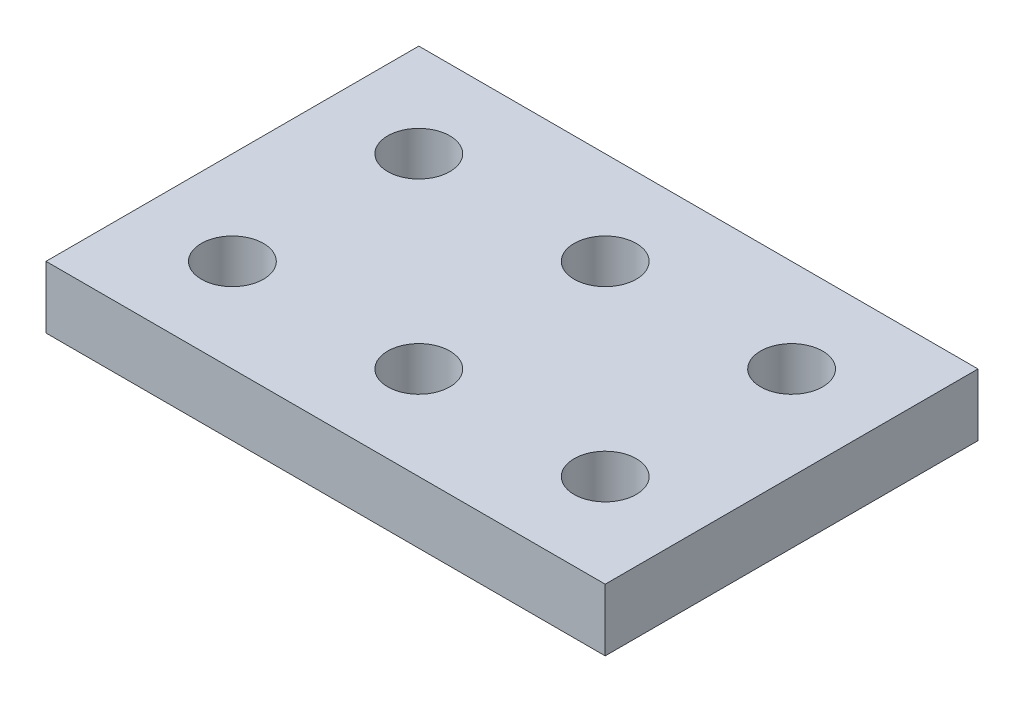
ISO-10303-21;
HEADER;
FILE_DESCRIPTION(('STEP AP214'),'2;1');
FILE_NAME('part.step','',(''),(''),'','','');
FILE_SCHEMA(('AUTOMOTIVE_DESIGN { 1 0 10303 214 1 1 1 1 }'));
ENDSEC;
DATA;
#1=APPLICATION_CONTEXT('core data for automotive mechanical design processes');
#2=APPLICATION_PROTOCOL_DEFINITION('international standard','automotive_design',2000,#1);
#3=PRODUCT_CONTEXT('',#1,'mechanical');
#4=PRODUCT('Part','Part','',(#3));
#5=PRODUCT_RELATED_PRODUCT_CATEGORY('part','',(#4));
#6=PRODUCT_DEFINITION_FORMATION('','',#4);
#7=PRODUCT_DEFINITION_CONTEXT('part definition',#1,'design');
#8=PRODUCT_DEFINITION('design','',#6,#7);
#9=PRODUCT_DEFINITION_SHAPE('','',#8);
#10=(LENGTH_UNIT() NAMED_UNIT(*) SI_UNIT(.MILLI.,.METRE.));
#11=(NAMED_UNIT(*) PLANE_ANGLE_UNIT() SI_UNIT($,.RADIAN.));
#12=(NAMED_UNIT(*) SI_UNIT($,.STERADIAN.) SOLID_ANGLE_UNIT());
#13=UNCERTAINTY_MEASURE_WITH_UNIT(LENGTH_MEASURE(1.E-05),#10,'distance_accuracy_value','');
#14=(GEOMETRIC_REPRESENTATION_CONTEXT(3) GLOBAL_UNCERTAINTY_ASSIGNED_CONTEXT((#13)) GLOBAL_UNIT_ASSIGNED_CONTEXT((#10,
#11,#12)) REPRESENTATION_CONTEXT('',''));
#15=CARTESIAN_POINT('',(0.,0.,0.));
#16=DIRECTION('',(0.,0.,1.));
#17=DIRECTION('',(1.,0.,0.));
#18=AXIS2_PLACEMENT_3D('',#15,#16,#17);
#19=CARTESIAN_POINT('',(0.,9.99999999999999,0.));
#20=DIRECTION('',(0.,1.,0.));
#21=DIRECTION('',(0.,0.,1.));
#22=AXIS2_PLACEMENT_3D('',#19,#20,#21);
#23=PLANE('',#22);
#24=CARTESIAN_POINT('',(75.0000000000003,10.,-15.));
#25=DIRECTION('',(0.,1.,0.));
#26=DIRECTION('',(0.,0.,1.));
#27=AXIS2_PLACEMENT_3D('',#24,#25,#26);
#28=CIRCLE('',#27,4.99999999999999);
#29=CARTESIAN_POINT('',(75.0000000000003,10.,-10.));
#30=VERTEX_POINT('',#29);
#31=EDGE_CURVE('E132',#30,#30,#28,.T.);
#32=ORIENTED_EDGE('',*,*,#31,.F.);
#33=EDGE_LOOP('',(#32));
#34=FACE_BOUND('',#33,.T.);
#35=CARTESIAN_POINT('',(75.,10.,-45.));
#36=DIRECTION('',(0.,1.,0.));
#37=DIRECTION('',(0.,0.,1.));
#38=AXIS2_PLACEMENT_3D('',#35,#36,#37);
#39=CIRCLE('',#38,5.);
#40=CARTESIAN_POINT('',(75.,10.,-40.));
#41=VERTEX_POINT('',#40);
#42=EDGE_CURVE('E120',#41,#41,#39,.T.);
#43=ORIENTED_EDGE('',*,*,#42,.F.);
#44=EDGE_LOOP('',(#43));
#45=FACE_BOUND('',#44,.T.);
#46=CARTESIAN_POINT('',(15.,10.,-45.));
#47=DIRECTION('',(0.,1.,0.));
#48=DIRECTION('',(0.,0.,1.));
#49=AXIS2_PLACEMENT_3D('',#46,#47,#48);
#50=CIRCLE('',#49,5.);
#51=CARTESIAN_POINT('',(15.,10.,-40.));
#52=VERTEX_POINT('',#51);
#53=EDGE_CURVE('E99',#52,#52,#50,.T.);
#54=ORIENTED_EDGE('',*,*,#53,.F.);
#55=EDGE_LOOP('',(#54));
#56=FACE_BOUND('',#55,.T.);
#57=DIRECTION('',(0.,0.,1.));
#58=VECTOR('',#57,1.);
#59=CARTESIAN_POINT('',(0.,9.99999999999999,-60.));
#60=LINE('',#59,#58);
#61=CARTESIAN_POINT('',(0.,9.99999999999999,-60.));
#62=VERTEX_POINT('',#61);
#63=CARTESIAN_POINT('',(0.,9.99999999999999,0.));
#64=VERTEX_POINT('',#63);
#65=EDGE_CURVE('E84',#62,#64,#60,.T.);
#66=ORIENTED_EDGE('',*,*,#65,.T.);
#67=DIRECTION('',(1.,0.,0.));
#68=VECTOR('',#67,1.);
#69=CARTESIAN_POINT('',(0.,9.99999999999999,0.));
#70=LINE('',#69,#68);
#71=CARTESIAN_POINT('',(90.,10.,0.));
#72=VERTEX_POINT('',#71);
#73=EDGE_CURVE('E79',#64,#72,#70,.T.);
#74=ORIENTED_EDGE('',*,*,#73,.T.);
#75=DIRECTION('',(0.,0.,-1.));
#76=VECTOR('',#75,1.);
#77=CARTESIAN_POINT('',(90.,10.,0.));
#78=LINE('',#77,#76);
#79=CARTESIAN_POINT('',(90.,10.,-60.));
#80=VERTEX_POINT('',#79);
#81=EDGE_CURVE('E82',#72,#80,#78,.T.);
#82=ORIENTED_EDGE('',*,*,#81,.T.);
#83=DIRECTION('',(-1.,0.,0.));
#84=VECTOR('',#83,1.);
#85=CARTESIAN_POINT('',(90.,10.,-60.));
#86=LINE('',#85,#84);
#87=EDGE_CURVE('E49',#80,#62,#86,.T.);
#88=ORIENTED_EDGE('',*,*,#87,.T.);
#89=EDGE_LOOP('',(#66,#74,#82,#88));
#90=FACE_BOUND('',#89,.T.);
#91=CARTESIAN_POINT('',(45.,10.0000000000001,-45.));
#92=DIRECTION('',(0.,1.,0.));
#93=DIRECTION('',(0.,0.,1.));
#94=AXIS2_PLACEMENT_3D('',#91,#92,#93);
#95=CIRCLE('',#94,5.);
#96=CARTESIAN_POINT('',(45.,10.0000000000001,-40.));
#97=VERTEX_POINT('',#96);
#98=EDGE_CURVE('E114',#97,#97,#95,.T.);
#99=ORIENTED_EDGE('',*,*,#98,.F.);
#100=EDGE_LOOP('',(#99));
#101=FACE_BOUND('',#100,.T.);
#102=CARTESIAN_POINT('',(45.0000000000003,10.0000000000001,-15.));
#103=DIRECTION('',(0.,1.,0.));
#104=DIRECTION('',(0.,0.,1.));
#105=AXIS2_PLACEMENT_3D('',#102,#103,#104);
#106=CIRCLE('',#105,5.);
#107=CARTESIAN_POINT('',(45.0000000000003,10.0000000000001,-10.));
#108=VERTEX_POINT('',#107);
#109=EDGE_CURVE('E126',#108,#108,#106,.T.);
#110=ORIENTED_EDGE('',*,*,#109,.F.);
#111=EDGE_LOOP('',(#110));
#112=FACE_BOUND('',#111,.T.);
#113=CARTESIAN_POINT('',(15.0000000000003,10.,-15.));
#114=DIRECTION('',(0.,1.,0.));
#115=DIRECTION('',(0.,0.,1.));
#116=AXIS2_PLACEMENT_3D('',#113,#114,#115);
#117=CIRCLE('',#116,5.);
#118=CARTESIAN_POINT('',(15.0000000000003,10.,-10.));
#119=VERTEX_POINT('',#118);
#120=EDGE_CURVE('E138',#119,#119,#117,.T.);
#121=ORIENTED_EDGE('',*,*,#120,.F.);
#122=EDGE_LOOP('',(#121));
#123=FACE_BOUND('',#122,.T.);
#124=ADVANCED_FACE('F32',(#34,#45,#56,#90,#101,#112,#123),#23,.T.);
#125=CARTESIAN_POINT('',(0.,0.,0.));
#126=DIRECTION('',(0.,1.,0.));
#127=DIRECTION('',(0.,0.,1.));
#128=AXIS2_PLACEMENT_3D('',#125,#126,#127);
#129=PLANE('',#128);
#130=DIRECTION('',(0.,0.,1.));
#131=VECTOR('',#130,1.);
#132=CARTESIAN_POINT('',(0.,0.,-60.));
#133=LINE('',#132,#131);
#134=CARTESIAN_POINT('',(0.,0.,-60.));
#135=VERTEX_POINT('',#134);
#136=CARTESIAN_POINT('',(0.,0.,0.));
#137=VERTEX_POINT('',#136);
#138=EDGE_CURVE('E96',#135,#137,#133,.T.);
#139=ORIENTED_EDGE('',*,*,#138,.F.);
#140=DIRECTION('',(-1.,0.,0.));
#141=VECTOR('',#140,1.);
#142=CARTESIAN_POINT('',(90.,0.,-60.));
#143=LINE('',#142,#141);
#144=CARTESIAN_POINT('',(90.,0.,-60.));
#145=VERTEX_POINT('',#144);
#146=EDGE_CURVE('E72',#145,#135,#143,.T.);
#147=ORIENTED_EDGE('',*,*,#146,.F.);
#148=DIRECTION('',(0.,0.,-1.));
#149=VECTOR('',#148,1.);
#150=CARTESIAN_POINT('',(90.,0.,0.));
#151=LINE('',#150,#149);
#152=CARTESIAN_POINT('',(90.,0.,0.));
#153=VERTEX_POINT('',#152);
#154=EDGE_CURVE('E66',#153,#145,#151,.T.);
#155=ORIENTED_EDGE('',*,*,#154,.F.);
#156=DIRECTION('',(1.,0.,0.));
#157=VECTOR('',#156,1.);
#158=CARTESIAN_POINT('',(0.,0.,0.));
#159=LINE('',#158,#157);
#160=EDGE_CURVE('E88',#137,#153,#159,.T.);
#161=ORIENTED_EDGE('',*,*,#160,.F.);
#162=EDGE_LOOP('',(#139,#147,#155,#161));
#163=FACE_BOUND('',#162,.T.);
#164=CARTESIAN_POINT('',(15.,0.,-45.));
#165=DIRECTION('',(0.,1.,0.));
#166=DIRECTION('',(0.,0.,1.));
#167=AXIS2_PLACEMENT_3D('',#164,#165,#166);
#168=CIRCLE('',#167,5.);
#169=CARTESIAN_POINT('',(15.,0.,-40.));
#170=VERTEX_POINT('',#169);
#171=EDGE_CURVE('E111',#170,#170,#168,.T.);
#172=ORIENTED_EDGE('',*,*,#171,.T.);
#173=EDGE_LOOP('',(#172));
#174=FACE_BOUND('',#173,.T.);
#175=CARTESIAN_POINT('',(44.9999999999999,0.,-45.));
#176=DIRECTION('',(0.,1.,0.));
#177=DIRECTION('',(0.,0.,1.));
#178=AXIS2_PLACEMENT_3D('',#175,#176,#177);
#179=CIRCLE('',#178,5.);
#180=CARTESIAN_POINT('',(44.9999999999999,0.,-40.));
#181=VERTEX_POINT('',#180);
#182=EDGE_CURVE('E117',#181,#181,#179,.T.);
#183=ORIENTED_EDGE('',*,*,#182,.T.);
#184=EDGE_LOOP('',(#183));
#185=FACE_BOUND('',#184,.T.);
#186=CARTESIAN_POINT('',(75.,0.,-45.));
#187=DIRECTION('',(0.,1.,0.));
#188=DIRECTION('',(0.,0.,1.));
#189=AXIS2_PLACEMENT_3D('',#186,#187,#188);
#190=CIRCLE('',#189,5.);
#191=CARTESIAN_POINT('',(75.,0.,-40.));
#192=VERTEX_POINT('',#191);
#193=EDGE_CURVE('E123',#192,#192,#190,.T.);
#194=ORIENTED_EDGE('',*,*,#193,.T.);
#195=EDGE_LOOP('',(#194));
#196=FACE_BOUND('',#195,.T.);
#197=CARTESIAN_POINT('',(45.0000000000002,0.,-15.));
#198=DIRECTION('',(0.,1.,0.));
#199=DIRECTION('',(0.,0.,1.));
#200=AXIS2_PLACEMENT_3D('',#197,#198,#199);
#201=CIRCLE('',#200,5.);
#202=CARTESIAN_POINT('',(45.0000000000002,0.,-10.));
#203=VERTEX_POINT('',#202);
#204=EDGE_CURVE('E129',#203,#203,#201,.T.);
#205=ORIENTED_EDGE('',*,*,#204,.T.);
#206=EDGE_LOOP('',(#205));
#207=FACE_BOUND('',#206,.T.);
#208=CARTESIAN_POINT('',(75.0000000000003,0.,-15.));
#209=DIRECTION('',(0.,1.,0.));
#210=DIRECTION('',(0.,0.,1.));
#211=AXIS2_PLACEMENT_3D('',#208,#209,#210);
#212=CIRCLE('',#211,4.99999999999999);
#213=CARTESIAN_POINT('',(75.0000000000003,0.,-10.));
#214=VERTEX_POINT('',#213);
#215=EDGE_CURVE('E135',#214,#214,#212,.T.);
#216=ORIENTED_EDGE('',*,*,#215,.T.);
#217=EDGE_LOOP('',(#216));
#218=FACE_BOUND('',#217,.T.);
#219=CARTESIAN_POINT('',(15.0000000000003,0.,-15.));
#220=DIRECTION('',(0.,1.,0.));
#221=DIRECTION('',(0.,0.,1.));
#222=AXIS2_PLACEMENT_3D('',#219,#220,#221);
#223=CIRCLE('',#222,5.);
#224=CARTESIAN_POINT('',(15.0000000000003,0.,-10.));
#225=VERTEX_POINT('',#224);
#226=EDGE_CURVE('E141',#225,#225,#223,.T.);
#227=ORIENTED_EDGE('',*,*,#226,.T.);
#228=EDGE_LOOP('',(#227));
#229=FACE_BOUND('',#228,.T.);
#230=ADVANCED_FACE('F107',(#163,#174,#185,#196,#207,#218,#229),#129,.F.);
#231=CARTESIAN_POINT('',(0.,9.99999999999999,-60.));
#232=DIRECTION('',(1.,0.,0.));
#233=DIRECTION('',(0.,0.,-1.));
#234=AXIS2_PLACEMENT_3D('',#231,#232,#233);
#235=PLANE('',#234);
#236=ORIENTED_EDGE('',*,*,#138,.T.);
#237=DIRECTION('',(0.,-1.,0.));
#238=VECTOR('',#237,1.);
#239=CARTESIAN_POINT('',(0.,9.99999999999999,0.));
#240=LINE('',#239,#238);
#241=EDGE_CURVE('E11',#64,#137,#240,.T.);
#242=ORIENTED_EDGE('',*,*,#241,.F.);
#243=ORIENTED_EDGE('',*,*,#65,.F.);
#244=DIRECTION('',(0.,-1.,0.));
#245=VECTOR('',#244,1.);
#246=CARTESIAN_POINT('',(0.,9.99999999999999,-60.));
#247=LINE('',#246,#245);
#248=EDGE_CURVE('E92',#62,#135,#247,.T.);
#249=ORIENTED_EDGE('',*,*,#248,.T.);
#250=EDGE_LOOP('',(#236,#242,#243,#249));
#251=FACE_BOUND('',#250,.T.);
#252=ADVANCED_FACE('F34',(#251),#235,.F.);
#253=CARTESIAN_POINT('',(0.,9.99999999999999,0.));
#254=DIRECTION('',(0.,0.,-1.));
#255=DIRECTION('',(-1.,0.,0.));
#256=AXIS2_PLACEMENT_3D('',#253,#254,#255);
#257=PLANE('',#256);
#258=ORIENTED_EDGE('',*,*,#160,.T.);
#259=DIRECTION('',(0.,-1.,0.));
#260=VECTOR('',#259,1.);
#261=CARTESIAN_POINT('',(90.,10.,0.));
#262=LINE('',#261,#260);
#263=EDGE_CURVE('E41',#72,#153,#262,.T.);
#264=ORIENTED_EDGE('',*,*,#263,.F.);
#265=ORIENTED_EDGE('',*,*,#73,.F.);
#266=ORIENTED_EDGE('',*,*,#241,.T.);
#267=EDGE_LOOP('',(#258,#264,#265,#266));
#268=FACE_BOUND('',#267,.T.);
#269=ADVANCED_FACE('F87',(#268),#257,.F.);
#270=CARTESIAN_POINT('',(90.,10.,0.));
#271=DIRECTION('',(-1.,0.,0.));
#272=DIRECTION('',(0.,0.,1.));
#273=AXIS2_PLACEMENT_3D('',#270,#271,#272);
#274=PLANE('',#273);
#275=ORIENTED_EDGE('',*,*,#154,.T.);
#276=DIRECTION('',(0.,-1.,0.));
#277=VECTOR('',#276,1.);
#278=CARTESIAN_POINT('',(90.,10.,-60.));
#279=LINE('',#278,#277);
#280=EDGE_CURVE('E89',#80,#145,#279,.T.);
#281=ORIENTED_EDGE('',*,*,#280,.F.);
#282=ORIENTED_EDGE('',*,*,#81,.F.);
#283=ORIENTED_EDGE('',*,*,#263,.T.);
#284=EDGE_LOOP('',(#275,#281,#282,#283));
#285=FACE_BOUND('',#284,.T.);
#286=ADVANCED_FACE('F90',(#285),#274,.F.);
#287=CARTESIAN_POINT('',(90.,10.,-60.));
#288=DIRECTION('',(0.,0.,1.));
#289=DIRECTION('',(1.,0.,0.));
#290=AXIS2_PLACEMENT_3D('',#287,#288,#289);
#291=PLANE('',#290);
#292=ORIENTED_EDGE('',*,*,#146,.T.);
#293=ORIENTED_EDGE('',*,*,#248,.F.);
#294=ORIENTED_EDGE('',*,*,#87,.F.);
#295=ORIENTED_EDGE('',*,*,#280,.T.);
#296=EDGE_LOOP('',(#292,#293,#294,#295));
#297=FACE_BOUND('',#296,.T.);
#298=ADVANCED_FACE('F104',(#297),#291,.F.);
#299=CARTESIAN_POINT('',(15.,10.,-45.));
#300=DIRECTION('',(0.,-1.,0.));
#301=DIRECTION('',(0.,0.,-1.));
#302=AXIS2_PLACEMENT_3D('',#299,#300,#301);
#303=CYLINDRICAL_SURFACE('',#302,5.);
#304=ORIENTED_EDGE('',*,*,#53,.T.);
#305=EDGE_LOOP('',(#304));
#306=FACE_BOUND('',#305,.T.);
#307=ORIENTED_EDGE('',*,*,#171,.F.);
#308=EDGE_LOOP('',(#307));
#309=FACE_BOUND('',#308,.T.);
#310=ADVANCED_FACE('F160',(#306,#309),#303,.F.);
#311=CARTESIAN_POINT('',(45.,10.0000000000001,-45.));
#312=DIRECTION('',(0.,-1.,0.));
#313=DIRECTION('',(0.,0.,-1.));
#314=AXIS2_PLACEMENT_3D('',#311,#312,#313);
#315=CYLINDRICAL_SURFACE('',#314,5.);
#316=ORIENTED_EDGE('',*,*,#98,.T.);
#317=EDGE_LOOP('',(#316));
#318=FACE_BOUND('',#317,.T.);
#319=ORIENTED_EDGE('',*,*,#182,.F.);
#320=EDGE_LOOP('',(#319));
#321=FACE_BOUND('',#320,.T.);
#322=ADVANCED_FACE('F195',(#318,#321),#315,.F.);
#323=CARTESIAN_POINT('',(75.,10.,-45.));
#324=DIRECTION('',(0.,-1.,0.));
#325=DIRECTION('',(0.,0.,-1.));
#326=AXIS2_PLACEMENT_3D('',#323,#324,#325);
#327=CYLINDRICAL_SURFACE('',#326,5.);
#328=ORIENTED_EDGE('',*,*,#42,.T.);
#329=EDGE_LOOP('',(#328));
#330=FACE_BOUND('',#329,.T.);
#331=ORIENTED_EDGE('',*,*,#193,.F.);
#332=EDGE_LOOP('',(#331));
#333=FACE_BOUND('',#332,.T.);
#334=ADVANCED_FACE('F202',(#330,#333),#327,.F.);
#335=CARTESIAN_POINT('',(45.0000000000003,10.0000000000001,-15.));
#336=DIRECTION('',(0.,-1.,0.));
#337=DIRECTION('',(0.,0.,-1.));
#338=AXIS2_PLACEMENT_3D('',#335,#336,#337);
#339=CYLINDRICAL_SURFACE('',#338,5.);
#340=ORIENTED_EDGE('',*,*,#109,.T.);
#341=EDGE_LOOP('',(#340));
#342=FACE_BOUND('',#341,.T.);
#343=ORIENTED_EDGE('',*,*,#204,.F.);
#344=EDGE_LOOP('',(#343));
#345=FACE_BOUND('',#344,.T.);
#346=ADVANCED_FACE('F209',(#342,#345),#339,.F.);
#347=CARTESIAN_POINT('',(75.0000000000003,10.,-15.));
#348=DIRECTION('',(0.,-1.,0.));
#349=DIRECTION('',(0.,0.,-1.));
#350=AXIS2_PLACEMENT_3D('',#347,#348,#349);
#351=CYLINDRICAL_SURFACE('',#350,4.99999999999999);
#352=ORIENTED_EDGE('',*,*,#31,.T.);
#353=EDGE_LOOP('',(#352));
#354=FACE_BOUND('',#353,.T.);
#355=ORIENTED_EDGE('',*,*,#215,.F.);
#356=EDGE_LOOP('',(#355));
#357=FACE_BOUND('',#356,.T.);
#358=ADVANCED_FACE('F217',(#354,#357),#351,.F.);
#359=CARTESIAN_POINT('',(15.0000000000003,10.,-15.));
#360=DIRECTION('',(0.,-1.,0.));
#361=DIRECTION('',(0.,0.,-1.));
#362=AXIS2_PLACEMENT_3D('',#359,#360,#361);
#363=CYLINDRICAL_SURFACE('',#362,5.);
#364=ORIENTED_EDGE('',*,*,#120,.T.);
#365=EDGE_LOOP('',(#364));
#366=FACE_BOUND('',#365,.T.);
#367=ORIENTED_EDGE('',*,*,#226,.F.);
#368=EDGE_LOOP('',(#367));
#369=FACE_BOUND('',#368,.T.);
#370=ADVANCED_FACE('F147',(#366,#369),#363,.F.);
#371=CLOSED_SHELL('',(#124,#230,#252,#269,#286,#298,#310,#322,#334,#346,#358,#370));
#372=MANIFOLD_SOLID_BREP('B2',#371);
#373=ADVANCED_BREP_SHAPE_REPRESENTATION('',(#18,#372),#14);
#374=SHAPE_DEFINITION_REPRESENTATION(#9,#373);
ENDSEC;
END-ISO-10303-21;
